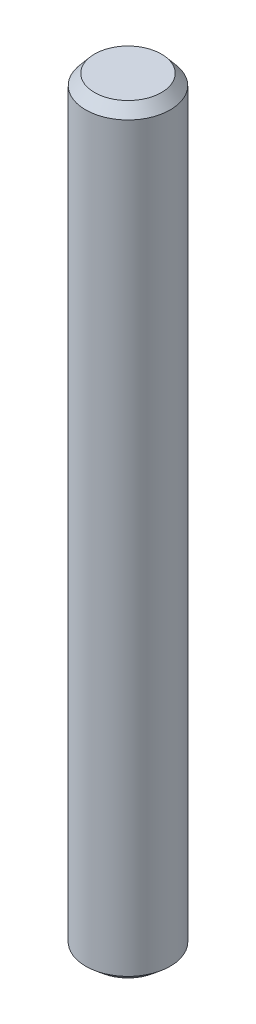
ISO-10303-21;
HEADER;
FILE_DESCRIPTION(('STEP AP214'),'2;1');
FILE_NAME('part.step','',(''),(''),'','','');
FILE_SCHEMA(('AUTOMOTIVE_DESIGN { 1 0 10303 214 1 1 1 1 }'));
ENDSEC;
DATA;
#1=APPLICATION_CONTEXT('core data for automotive mechanical design processes');
#2=APPLICATION_PROTOCOL_DEFINITION('international standard','automotive_design',2000,#1);
#3=PRODUCT_CONTEXT('',#1,'mechanical');
#4=PRODUCT('Part','Part','',(#3));
#5=PRODUCT_RELATED_PRODUCT_CATEGORY('part','',(#4));
#6=PRODUCT_DEFINITION_FORMATION('','',#4);
#7=PRODUCT_DEFINITION_CONTEXT('part definition',#1,'design');
#8=PRODUCT_DEFINITION('design','',#6,#7);
#9=PRODUCT_DEFINITION_SHAPE('','',#8);
#10=(LENGTH_UNIT() NAMED_UNIT(*) SI_UNIT(.MILLI.,.METRE.));
#11=(NAMED_UNIT(*) PLANE_ANGLE_UNIT() SI_UNIT($,.RADIAN.));
#12=(NAMED_UNIT(*) SI_UNIT($,.STERADIAN.) SOLID_ANGLE_UNIT());
#13=UNCERTAINTY_MEASURE_WITH_UNIT(LENGTH_MEASURE(1.E-05),#10,'distance_accuracy_value','');
#14=(GEOMETRIC_REPRESENTATION_CONTEXT(3) GLOBAL_UNCERTAINTY_ASSIGNED_CONTEXT((#13)) GLOBAL_UNIT_ASSIGNED_CONTEXT((#10,
#11,#12)) REPRESENTATION_CONTEXT('',''));
#15=CARTESIAN_POINT('',(0.,0.,0.));
#16=DIRECTION('',(0.,0.,1.));
#17=DIRECTION('',(1.,0.,0.));
#18=AXIS2_PLACEMENT_3D('',#15,#16,#17);
#19=CARTESIAN_POINT('',(0.,72.,0.));
#20=DIRECTION('',(0.,-1.,0.));
#21=DIRECTION('',(0.,0.,-1.));
#22=AXIS2_PLACEMENT_3D('',#19,#20,#21);
#23=CYLINDRICAL_SURFACE('',#22,4.);
#24=CARTESIAN_POINT('',(0.,0.839099631177273,0.));
#25=DIRECTION('',(0.,1.,0.));
#26=DIRECTION('',(0.,0.,1.));
#27=AXIS2_PLACEMENT_3D('',#24,#25,#26);
#28=CIRCLE('',#27,4.);
#29=CARTESIAN_POINT('',(0.,0.839099631177273,4.));
#30=VERTEX_POINT('',#29);
#31=EDGE_CURVE('E56',#30,#30,#28,.T.);
#32=ORIENTED_EDGE('',*,*,#31,.T.);
#33=EDGE_LOOP('',(#32));
#34=FACE_BOUND('',#33,.T.);
#35=CARTESIAN_POINT('',(0.,71.,0.));
#36=DIRECTION('',(0.,1.,0.));
#37=DIRECTION('',(0.,0.,1.));
#38=AXIS2_PLACEMENT_3D('',#35,#36,#37);
#39=CIRCLE('',#38,4.);
#40=CARTESIAN_POINT('',(0.,71.,4.));
#41=VERTEX_POINT('',#40);
#42=EDGE_CURVE('E60',#41,#41,#39,.F.);
#43=ORIENTED_EDGE('',*,*,#42,.T.);
#44=EDGE_LOOP('',(#43));
#45=FACE_BOUND('',#44,.T.);
#46=ADVANCED_FACE('F45',(#34,#45),#23,.T.);
#47=CARTESIAN_POINT('',(0.,72.,0.));
#48=DIRECTION('',(0.,1.,0.));
#49=DIRECTION('',(0.,0.,1.));
#50=AXIS2_PLACEMENT_3D('',#47,#48,#49);
#51=PLANE('',#50);
#52=CARTESIAN_POINT('',(0.,72.,0.));
#53=DIRECTION('',(0.,1.,0.));
#54=DIRECTION('',(0.,0.,1.));
#55=AXIS2_PLACEMENT_3D('',#52,#53,#54);
#56=CIRCLE('',#55,3.16090036882271);
#57=CARTESIAN_POINT('',(0.,72.,3.16090036882271));
#58=VERTEX_POINT('',#57);
#59=EDGE_CURVE('E10',#58,#58,#56,.T.);
#60=ORIENTED_EDGE('',*,*,#59,.T.);
#61=EDGE_LOOP('',(#60));
#62=FACE_BOUND('',#61,.T.);
#63=ADVANCED_FACE('F76',(#62),#51,.T.);
#64=CARTESIAN_POINT('',(0.,0.,0.));
#65=DIRECTION('',(0.,1.,0.));
#66=DIRECTION('',(0.,0.,1.));
#67=AXIS2_PLACEMENT_3D('',#64,#65,#66);
#68=PLANE('',#67);
#69=CARTESIAN_POINT('',(0.,0.,0.));
#70=DIRECTION('',(0.,1.,0.));
#71=DIRECTION('',(0.,0.,1.));
#72=AXIS2_PLACEMENT_3D('',#69,#70,#71);
#73=CIRCLE('',#72,3.00000000000001);
#74=CARTESIAN_POINT('',(0.,0.,3.00000000000001));
#75=VERTEX_POINT('',#74);
#76=EDGE_CURVE('E52',#75,#75,#73,.F.);
#77=ORIENTED_EDGE('',*,*,#76,.T.);
#78=EDGE_LOOP('',(#77));
#79=FACE_BOUND('',#78,.T.);
#80=ADVANCED_FACE('F73',(#79),#68,.F.);
#81=CARTESIAN_POINT('',(0.,0.839099631177273,0.));
#82=DIRECTION('',(0.,1.,0.));
#83=DIRECTION('',(0.,0.,1.));
#84=AXIS2_PLACEMENT_3D('',#81,#82,#83);
#85=CONICAL_SURFACE('',#84,4.,0.872664625997164);
#86=ORIENTED_EDGE('',*,*,#76,.F.);
#87=EDGE_LOOP('',(#86));
#88=FACE_BOUND('',#87,.T.);
#89=ORIENTED_EDGE('',*,*,#31,.F.);
#90=EDGE_LOOP('',(#89));
#91=FACE_BOUND('',#90,.T.);
#92=ADVANCED_FACE('F69',(#88,#91),#85,.T.);
#93=CARTESIAN_POINT('',(0.,72.,0.));
#94=DIRECTION('',(0.,-1.,0.));
#95=DIRECTION('',(0.,0.,-1.));
#96=AXIS2_PLACEMENT_3D('',#93,#94,#95);
#97=CONICAL_SURFACE('',#96,3.16090036882271,0.698131700797731);
#98=ORIENTED_EDGE('',*,*,#42,.F.);
#99=EDGE_LOOP('',(#98));
#100=FACE_BOUND('',#99,.T.);
#101=ORIENTED_EDGE('',*,*,#59,.F.);
#102=EDGE_LOOP('',(#101));
#103=FACE_BOUND('',#102,.T.);
#104=ADVANCED_FACE('F47',(#100,#103),#97,.T.);
#105=CLOSED_SHELL('',(#46,#63,#80,#92,#104));
#106=MANIFOLD_SOLID_BREP('B2',#105);
#107=ADVANCED_BREP_SHAPE_REPRESENTATION('',(#18,#106),#14);
#108=SHAPE_DEFINITION_REPRESENTATION(#9,#107);
ENDSEC;
END-ISO-10303-21;
